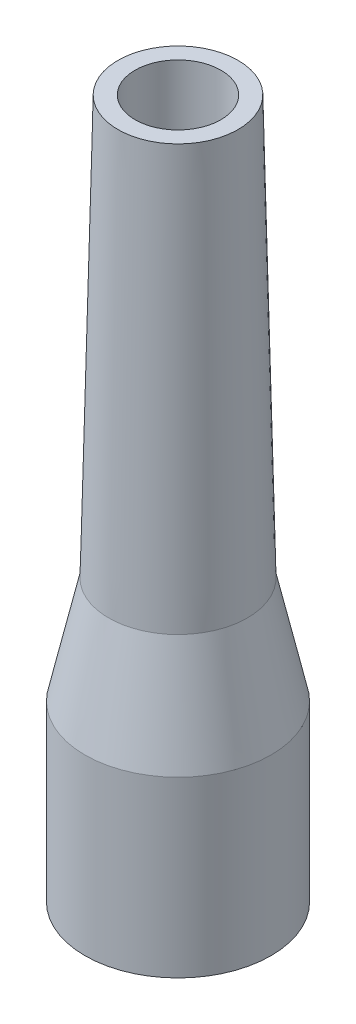
ISO-10303-21;
HEADER;
FILE_DESCRIPTION(('STEP AP214'),'2;1');
FILE_NAME('part.step','',(''),(''),'','','');
FILE_SCHEMA(('AUTOMOTIVE_DESIGN { 1 0 10303 214 1 1 1 1 }'));
ENDSEC;
DATA;
#1=APPLICATION_CONTEXT('core data for automotive mechanical design processes');
#2=APPLICATION_PROTOCOL_DEFINITION('international standard','automotive_design',2000,#1);
#3=PRODUCT_CONTEXT('',#1,'mechanical');
#4=PRODUCT('Part','Part','',(#3));
#5=PRODUCT_RELATED_PRODUCT_CATEGORY('part','',(#4));
#6=PRODUCT_DEFINITION_FORMATION('','',#4);
#7=PRODUCT_DEFINITION_CONTEXT('part definition',#1,'design');
#8=PRODUCT_DEFINITION('design','',#6,#7);
#9=PRODUCT_DEFINITION_SHAPE('','',#8);
#10=(LENGTH_UNIT() NAMED_UNIT(*) SI_UNIT(.MILLI.,.METRE.));
#11=(NAMED_UNIT(*) PLANE_ANGLE_UNIT() SI_UNIT($,.RADIAN.));
#12=(NAMED_UNIT(*) SI_UNIT($,.STERADIAN.) SOLID_ANGLE_UNIT());
#13=UNCERTAINTY_MEASURE_WITH_UNIT(LENGTH_MEASURE(1.E-05),#10,'distance_accuracy_value','');
#14=(GEOMETRIC_REPRESENTATION_CONTEXT(3) GLOBAL_UNCERTAINTY_ASSIGNED_CONTEXT((#13)) GLOBAL_UNIT_ASSIGNED_CONTEXT((#10,
#11,#12)) REPRESENTATION_CONTEXT('',''));
#15=CARTESIAN_POINT('',(0.,0.,0.));
#16=DIRECTION('',(0.,0.,1.));
#17=DIRECTION('',(1.,0.,0.));
#18=AXIS2_PLACEMENT_3D('',#15,#16,#17);
#19=CARTESIAN_POINT('',(0.,63.4816576831156,3.9));
#20=DIRECTION('',(0.,-1.,0.));
#21=DIRECTION('',(0.,0.,-1.));
#22=AXIS2_PLACEMENT_3D('',#19,#20,#21);
#23=PLANE('',#22);
#24=CARTESIAN_POINT('',(0.,63.4816576831156,0.));
#25=DIRECTION('',(0.,-1.,0.));
#26=DIRECTION('',(0.,0.,-1.));
#27=AXIS2_PLACEMENT_3D('',#24,#25,#26);
#28=CIRCLE('',#27,5.45002502044322);
#29=CARTESIAN_POINT('',(0.,63.4816576831156,-5.45002502044322));
#30=VERTEX_POINT('',#29);
#31=EDGE_CURVE('E72',#30,#30,#28,.T.);
#32=ORIENTED_EDGE('',*,*,#31,.F.);
#33=EDGE_LOOP('',(#32));
#34=FACE_BOUND('',#33,.T.);
#35=CARTESIAN_POINT('',(0.,63.4816576831156,0.));
#36=DIRECTION('',(0.,-1.,0.));
#37=DIRECTION('',(0.,0.,-1.));
#38=AXIS2_PLACEMENT_3D('',#35,#36,#37);
#39=CIRCLE('',#38,3.9);
#40=CARTESIAN_POINT('',(0.,63.4816576831156,-3.9));
#41=VERTEX_POINT('',#40);
#42=EDGE_CURVE('E10',#41,#41,#39,.T.);
#43=ORIENTED_EDGE('',*,*,#42,.T.);
#44=EDGE_LOOP('',(#43));
#45=FACE_BOUND('',#44,.T.);
#46=ADVANCED_FACE('F37',(#34,#45),#23,.F.);
#47=CARTESIAN_POINT('',(0.,0.,0.));
#48=DIRECTION('',(0.,-1.,0.));
#49=DIRECTION('',(0.,0.,-1.));
#50=AXIS2_PLACEMENT_3D('',#47,#48,#49);
#51=CYLINDRICAL_SURFACE('',#50,3.9);
#52=ORIENTED_EDGE('',*,*,#42,.F.);
#53=EDGE_LOOP('',(#52));
#54=FACE_BOUND('',#53,.T.);
#55=CARTESIAN_POINT('',(0.,43.8524849935838,0.));
#56=DIRECTION('',(0.,-1.,0.));
#57=DIRECTION('',(0.,0.,-1.));
#58=AXIS2_PLACEMENT_3D('',#55,#56,#57);
#59=CIRCLE('',#58,3.9);
#60=CARTESIAN_POINT('',(0.,43.8524849935838,-3.9));
#61=VERTEX_POINT('',#60);
#62=EDGE_CURVE('E44',#61,#61,#59,.T.);
#63=ORIENTED_EDGE('',*,*,#62,.T.);
#64=EDGE_LOOP('',(#63));
#65=FACE_BOUND('',#64,.T.);
#66=ADVANCED_FACE('F80',(#54,#65),#51,.F.);
#67=CARTESIAN_POINT('',(0.,38.890840172158,0.));
#68=DIRECTION('',(0.,-1.,0.));
#69=DIRECTION('',(0.,0.,-1.));
#70=AXIS2_PLACEMENT_3D('',#67,#68,#69);
#71=CONICAL_SURFACE('',#70,4.99997017484004,0.218166156499284);
#72=ORIENTED_EDGE('',*,*,#62,.F.);
#73=EDGE_LOOP('',(#72));
#74=FACE_BOUND('',#73,.T.);
#75=CARTESIAN_POINT('',(0.,38.890840172158,0.));
#76=DIRECTION('',(0.,-1.,0.));
#77=DIRECTION('',(0.,0.,-1.));
#78=AXIS2_PLACEMENT_3D('',#75,#76,#77);
#79=CIRCLE('',#78,4.99997017484004);
#80=CARTESIAN_POINT('',(0.,38.890840172158,-4.99997017484004));
#81=VERTEX_POINT('',#80);
#82=EDGE_CURVE('E49',#81,#81,#79,.T.);
#83=ORIENTED_EDGE('',*,*,#82,.T.);
#84=EDGE_LOOP('',(#83));
#85=FACE_BOUND('',#84,.T.);
#86=ADVANCED_FACE('F84',(#74,#85),#71,.F.);
#87=CARTESIAN_POINT('',(0.,0.00244215938302648,0.));
#88=DIRECTION('',(0.,-1.,0.));
#89=DIRECTION('',(0.,0.,-1.));
#90=AXIS2_PLACEMENT_3D('',#87,#88,#89);
#91=CONICAL_SURFACE('',#90,5.94997017484004,0.0244240220464994);
#92=ORIENTED_EDGE('',*,*,#82,.F.);
#93=EDGE_LOOP('',(#92));
#94=FACE_BOUND('',#93,.T.);
#95=CARTESIAN_POINT('',(0.,0.00244215938302648,0.));
#96=DIRECTION('',(0.,-1.,0.));
#97=DIRECTION('',(0.,0.,-1.));
#98=AXIS2_PLACEMENT_3D('',#95,#96,#97);
#99=CIRCLE('',#98,5.94997017484004);
#100=CARTESIAN_POINT('',(0.,0.00244215938302648,-5.94997017484004));
#101=VERTEX_POINT('',#100);
#102=EDGE_CURVE('E54',#101,#101,#99,.T.);
#103=ORIENTED_EDGE('',*,*,#102,.T.);
#104=EDGE_LOOP('',(#103));
#105=FACE_BOUND('',#104,.T.);
#106=ADVANCED_FACE('F89',(#94,#105),#91,.F.);
#107=CARTESIAN_POINT('',(0.,0.00244215938302961,5.94997017484004));
#108=DIRECTION('',(0.,1.,0.));
#109=DIRECTION('',(0.,0.,1.));
#110=AXIS2_PLACEMENT_3D('',#107,#108,#109);
#111=PLANE('',#110);
#112=ORIENTED_EDGE('',*,*,#102,.F.);
#113=EDGE_LOOP('',(#112));
#114=FACE_BOUND('',#113,.T.);
#115=CARTESIAN_POINT('',(0.,0.00244215938303275,0.));
#116=DIRECTION('',(0.,-1.,0.));
#117=DIRECTION('',(0.,0.,-1.));
#118=AXIS2_PLACEMENT_3D('',#115,#116,#117);
#119=CIRCLE('',#118,8.44997017484004);
#120=CARTESIAN_POINT('',(0.,0.00244215938303275,-8.44997017484004));
#121=VERTEX_POINT('',#120);
#122=EDGE_CURVE('E60',#121,#121,#119,.T.);
#123=ORIENTED_EDGE('',*,*,#122,.T.);
#124=EDGE_LOOP('',(#123));
#125=FACE_BOUND('',#124,.T.);
#126=ADVANCED_FACE('F95',(#114,#125),#111,.F.);
#127=CARTESIAN_POINT('',(0.,0.,0.));
#128=DIRECTION('',(0.,-1.,0.));
#129=DIRECTION('',(0.,0.,-1.));
#130=AXIS2_PLACEMENT_3D('',#127,#128,#129);
#131=CYLINDRICAL_SURFACE('',#130,8.44997017484004);
#132=ORIENTED_EDGE('',*,*,#122,.F.);
#133=EDGE_LOOP('',(#132));
#134=FACE_BOUND('',#133,.T.);
#135=CARTESIAN_POINT('',(0.,15.7933895611615,0.));
#136=DIRECTION('',(0.,-1.,0.));
#137=DIRECTION('',(0.,0.,-1.));
#138=AXIS2_PLACEMENT_3D('',#135,#136,#137);
#139=CIRCLE('',#138,8.44997017484004);
#140=CARTESIAN_POINT('',(0.,15.7933895611615,-8.44997017484004));
#141=VERTEX_POINT('',#140);
#142=EDGE_CURVE('E64',#141,#141,#139,.T.);
#143=ORIENTED_EDGE('',*,*,#142,.T.);
#144=EDGE_LOOP('',(#143));
#145=FACE_BOUND('',#144,.T.);
#146=ADVANCED_FACE('F99',(#134,#145),#131,.T.);
#147=CARTESIAN_POINT('',(0.,25.4911654515058,0.));
#148=DIRECTION('',(0.,-1.,0.));
#149=DIRECTION('',(0.,0.,-1.));
#150=AXIS2_PLACEMENT_3D('',#147,#148,#149);
#151=CONICAL_SURFACE('',#150,6.30002502044323,0.218166156499299);
#152=ORIENTED_EDGE('',*,*,#142,.F.);
#153=EDGE_LOOP('',(#152));
#154=FACE_BOUND('',#153,.T.);
#155=CARTESIAN_POINT('',(0.,25.4911654515058,0.));
#156=DIRECTION('',(0.,-1.,0.));
#157=DIRECTION('',(0.,0.,-1.));
#158=AXIS2_PLACEMENT_3D('',#155,#156,#157);
#159=CIRCLE('',#158,6.30002502044323);
#160=CARTESIAN_POINT('',(0.,25.4911654515058,-6.30002502044323));
#161=VERTEX_POINT('',#160);
#162=EDGE_CURVE('E68',#161,#161,#159,.T.);
#163=ORIENTED_EDGE('',*,*,#162,.T.);
#164=EDGE_LOOP('',(#163));
#165=FACE_BOUND('',#164,.T.);
#166=ADVANCED_FACE('F103',(#154,#165),#151,.T.);
#167=CARTESIAN_POINT('',(0.,63.4816576831156,0.));
#168=DIRECTION('',(0.,-1.,0.));
#169=DIRECTION('',(0.,0.,-1.));
#170=AXIS2_PLACEMENT_3D('',#167,#168,#169);
#171=CONICAL_SURFACE('',#170,5.45002502044322,0.0223702867987168);
#172=ORIENTED_EDGE('',*,*,#162,.F.);
#173=EDGE_LOOP('',(#172));
#174=FACE_BOUND('',#173,.T.);
#175=ORIENTED_EDGE('',*,*,#31,.T.);
#176=EDGE_LOOP('',(#175));
#177=FACE_BOUND('',#176,.T.);
#178=ADVANCED_FACE('F77',(#174,#177),#171,.T.);
#179=CLOSED_SHELL('',(#46,#66,#86,#106,#126,#146,#166,#178));
#180=MANIFOLD_SOLID_BREP('B2',#179);
#181=ADVANCED_BREP_SHAPE_REPRESENTATION('',(#18,#180),#14);
#182=SHAPE_DEFINITION_REPRESENTATION(#9,#181);
ENDSEC;
END-ISO-10303-21;
